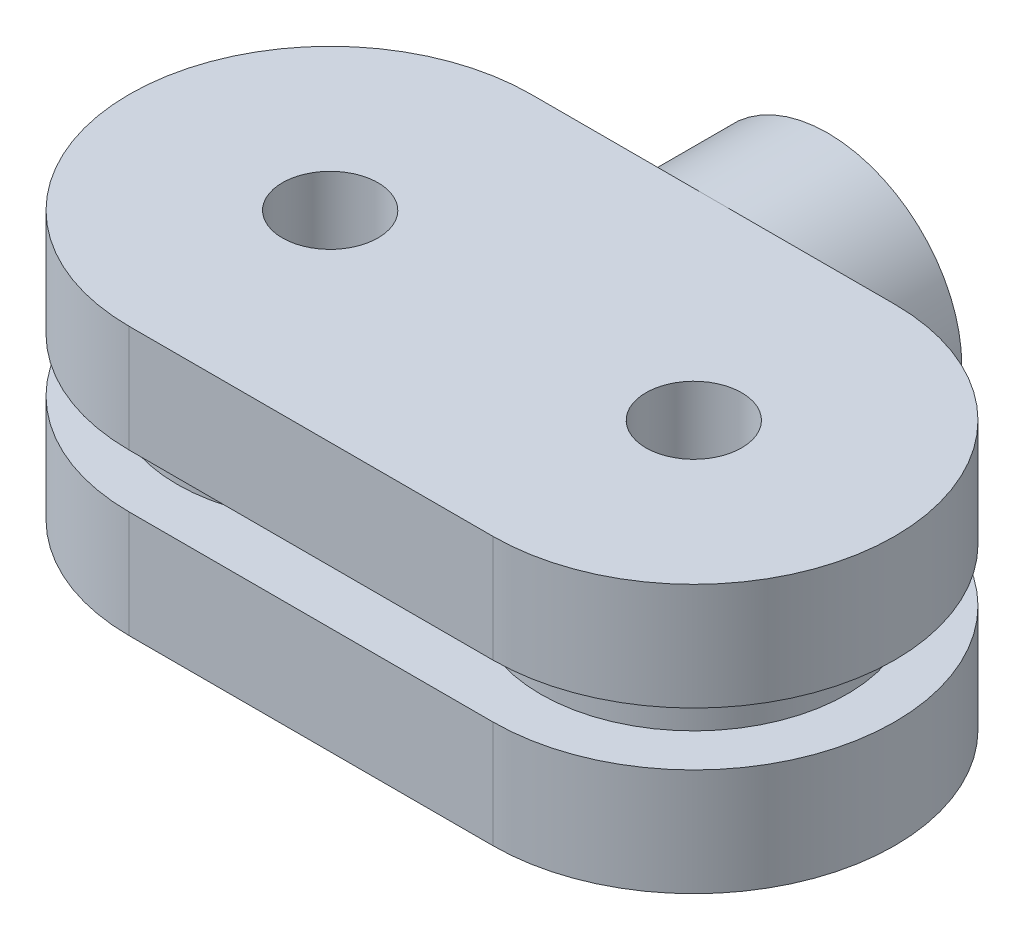
ISO-10303-21;
HEADER;
FILE_DESCRIPTION(('STEP AP214'),'2;1');
FILE_NAME('part.step','',(''),(''),'','','');
FILE_SCHEMA(('AUTOMOTIVE_DESIGN { 1 0 10303 214 1 1 1 1 }'));
ENDSEC;
DATA;
#1=APPLICATION_CONTEXT('core data for automotive mechanical design processes');
#2=APPLICATION_PROTOCOL_DEFINITION('international standard','automotive_design',2000,#1);
#3=PRODUCT_CONTEXT('',#1,'mechanical');
#4=PRODUCT('Part','Part','',(#3));
#5=PRODUCT_RELATED_PRODUCT_CATEGORY('part','',(#4));
#6=PRODUCT_DEFINITION_FORMATION('','',#4);
#7=PRODUCT_DEFINITION_CONTEXT('part definition',#1,'design');
#8=PRODUCT_DEFINITION('design','',#6,#7);
#9=PRODUCT_DEFINITION_SHAPE('','',#8);
#10=(LENGTH_UNIT() NAMED_UNIT(*) SI_UNIT(.MILLI.,.METRE.));
#11=(NAMED_UNIT(*) PLANE_ANGLE_UNIT() SI_UNIT($,.RADIAN.));
#12=(NAMED_UNIT(*) SI_UNIT($,.STERADIAN.) SOLID_ANGLE_UNIT());
#13=UNCERTAINTY_MEASURE_WITH_UNIT(LENGTH_MEASURE(1.E-05),#10,'distance_accuracy_value','');
#14=(GEOMETRIC_REPRESENTATION_CONTEXT(3) GLOBAL_UNCERTAINTY_ASSIGNED_CONTEXT((#13)) GLOBAL_UNIT_ASSIGNED_CONTEXT((#10,
#11,#12)) REPRESENTATION_CONTEXT('',''));
#15=CARTESIAN_POINT('',(0.,0.,0.));
#16=DIRECTION('',(0.,0.,1.));
#17=DIRECTION('',(1.,0.,0.));
#18=AXIS2_PLACEMENT_3D('',#15,#16,#17);
#19=CARTESIAN_POINT('',(0.,2.8,-5.25));
#20=DIRECTION('',(0.,0.,1.));
#21=DIRECTION('',(1.,0.,0.));
#22=AXIS2_PLACEMENT_3D('',#19,#20,#21);
#23=PLANE('',#22);
#24=DIRECTION('',(-1.,0.,0.));
#25=VECTOR('',#24,1.);
#26=CARTESIAN_POINT('',(0.,2.8,-5.25));
#27=LINE('',#26,#25);
#28=CARTESIAN_POINT('',(6.62349939951952,2.8,-5.25));
#29=VERTEX_POINT('',#28);
#30=CARTESIAN_POINT('',(2.87650060048048,2.8,-5.25));
#31=VERTEX_POINT('',#30);
#32=EDGE_CURVE('E57',#29,#31,#27,.T.);
#33=ORIENTED_EDGE('',*,*,#32,.F.);
#34=CARTESIAN_POINT('',(4.75,3.5,-5.25));
#35=DIRECTION('',(0.,0.,-1.));
#36=DIRECTION('',(-1.,0.,0.));
#37=AXIS2_PLACEMENT_3D('',#34,#35,#36);
#38=CIRCLE('',#37,2.);
#39=EDGE_CURVE('E54',#29,#31,#38,.T.);
#40=ORIENTED_EDGE('',*,*,#39,.T.);
#41=EDGE_LOOP('',(#33,#40));
#42=FACE_BOUND('',#41,.T.);
#43=ADVANCED_FACE('F40',(#42),#23,.F.);
#44=CARTESIAN_POINT('',(4.75,3.5,-5.25));
#45=DIRECTION('',(0.,0.,-1.));
#46=DIRECTION('',(-1.,0.,0.));
#47=AXIS2_PLACEMENT_3D('',#44,#45,#46);
#48=CIRCLE('',#47,3.5);
#49=CARTESIAN_POINT('',(8.17928563989645,2.8,-5.25));
#50=VERTEX_POINT('',#49);
#51=CARTESIAN_POINT('',(4.75,0.,-5.25));
#52=VERTEX_POINT('',#51);
#53=EDGE_CURVE('E164',#50,#52,#48,.T.);
#54=ORIENTED_EDGE('',*,*,#53,.F.);
#55=CARTESIAN_POINT('',(9.5,2.8,-5.25));
#56=VERTEX_POINT('',#55);
#57=EDGE_CURVE('E265',#56,#50,#27,.T.);
#58=ORIENTED_EDGE('',*,*,#57,.F.);
#59=DIRECTION('',(0.,-1.,0.));
#60=VECTOR('',#59,1.);
#61=CARTESIAN_POINT('',(9.5,2.8,-5.25));
#62=LINE('',#61,#60);
#63=CARTESIAN_POINT('',(9.5,0.,-5.25));
#64=VERTEX_POINT('',#63);
#65=EDGE_CURVE('E255',#56,#64,#62,.T.);
#66=ORIENTED_EDGE('',*,*,#65,.T.);
#67=DIRECTION('',(-1.,0.,0.));
#68=VECTOR('',#67,1.);
#69=CARTESIAN_POINT('',(0.,0.,-5.25));
#70=LINE('',#69,#68);
#71=EDGE_CURVE('E246',#64,#52,#70,.T.);
#72=ORIENTED_EDGE('',*,*,#71,.T.);
#73=EDGE_LOOP('',(#54,#58,#66,#72));
#74=FACE_BOUND('',#73,.T.);
#75=ADVANCED_FACE('F210',(#74),#23,.F.);
#76=CARTESIAN_POINT('',(0.,7.,-5.25));
#77=DIRECTION('',(0.,0.,1.));
#78=DIRECTION('',(1.,0.,0.));
#79=AXIS2_PLACEMENT_3D('',#76,#77,#78);
#80=PLANE('',#79);
#81=DIRECTION('',(-1.,0.,0.));
#82=VECTOR('',#81,1.);
#83=CARTESIAN_POINT('',(0.,4.2,-5.25));
#84=LINE('',#83,#82);
#85=CARTESIAN_POINT('',(6.62349939951952,4.2,-5.25));
#86=VERTEX_POINT('',#85);
#87=CARTESIAN_POINT('',(2.87650060048048,4.2,-5.25));
#88=VERTEX_POINT('',#87);
#89=EDGE_CURVE('E152',#86,#88,#84,.T.);
#90=ORIENTED_EDGE('',*,*,#89,.T.);
#91=EDGE_CURVE('E181',#88,#86,#38,.T.);
#92=ORIENTED_EDGE('',*,*,#91,.T.);
#93=EDGE_LOOP('',(#90,#92));
#94=FACE_BOUND('',#93,.T.);
#95=ADVANCED_FACE('F216',(#94),#80,.F.);
#96=CARTESIAN_POINT('',(1.32071436010355,4.2,-5.25));
#97=VERTEX_POINT('',#96);
#98=CARTESIAN_POINT('',(4.75,7.,-5.25));
#99=VERTEX_POINT('',#98);
#100=EDGE_CURVE('E163',#97,#99,#48,.T.);
#101=ORIENTED_EDGE('',*,*,#100,.F.);
#102=CARTESIAN_POINT('',(0.,4.2,-5.25));
#103=VERTEX_POINT('',#102);
#104=EDGE_CURVE('E145',#97,#103,#84,.T.);
#105=ORIENTED_EDGE('',*,*,#104,.T.);
#106=DIRECTION('',(0.,-1.,0.));
#107=VECTOR('',#106,1.);
#108=CARTESIAN_POINT('',(0.,7.,-5.25));
#109=LINE('',#108,#107);
#110=CARTESIAN_POINT('',(0.,7.,-5.25));
#111=VERTEX_POINT('',#110);
#112=EDGE_CURVE('E367',#111,#103,#109,.T.);
#113=ORIENTED_EDGE('',*,*,#112,.F.);
#114=DIRECTION('',(-1.,0.,0.));
#115=VECTOR('',#114,1.);
#116=CARTESIAN_POINT('',(0.,7.,-5.25));
#117=LINE('',#116,#115);
#118=EDGE_CURVE('E363',#99,#111,#117,.T.);
#119=ORIENTED_EDGE('',*,*,#118,.F.);
#120=EDGE_LOOP('',(#101,#105,#113,#119));
#121=FACE_BOUND('',#120,.T.);
#122=ADVANCED_FACE('F307',(#121),#80,.F.);
#123=CARTESIAN_POINT('',(0.,2.8,0.));
#124=DIRECTION('',(0.,1.,0.));
#125=DIRECTION('',(0.,0.,1.));
#126=AXIS2_PLACEMENT_3D('',#123,#124,#125);
#127=PLANE('',#126);
#128=CARTESIAN_POINT('',(0.,2.8,0.));
#129=DIRECTION('',(0.,1.,0.));
#130=DIRECTION('',(0.,0.,1.));
#131=AXIS2_PLACEMENT_3D('',#128,#129,#130);
#132=CIRCLE('',#131,5.25);
#133=CARTESIAN_POINT('',(0.,2.8,-5.25));
#134=VERTEX_POINT('',#133);
#135=CARTESIAN_POINT('',(0.,2.8,5.25));
#136=VERTEX_POINT('',#135);
#137=EDGE_CURVE('E256',#134,#136,#132,.T.);
#138=ORIENTED_EDGE('',*,*,#137,.T.);
#139=DIRECTION('',(1.,0.,0.));
#140=VECTOR('',#139,1.);
#141=CARTESIAN_POINT('',(0.,2.8,5.25));
#142=LINE('',#141,#140);
#143=CARTESIAN_POINT('',(9.5,2.8,5.25));
#144=VERTEX_POINT('',#143);
#145=EDGE_CURVE('E258',#136,#144,#142,.T.);
#146=ORIENTED_EDGE('',*,*,#145,.T.);
#147=CARTESIAN_POINT('',(9.5,2.8,0.));
#148=DIRECTION('',(0.,1.,0.));
#149=DIRECTION('',(0.,0.,1.));
#150=AXIS2_PLACEMENT_3D('',#147,#148,#149);
#151=CIRCLE('',#150,5.25);
#152=EDGE_CURVE('E288',#144,#56,#151,.T.);
#153=ORIENTED_EDGE('',*,*,#152,.T.);
#154=ORIENTED_EDGE('',*,*,#57,.T.);
#155=DIRECTION('',(-1.,0.,0.));
#156=VECTOR('',#155,1.);
#157=CARTESIAN_POINT('',(0.,2.8,-5.25));
#158=LINE('',#157,#156);
#159=EDGE_CURVE('E160',#50,#29,#158,.T.);
#160=ORIENTED_EDGE('',*,*,#159,.T.);
#161=ORIENTED_EDGE('',*,*,#32,.T.);
#162=CARTESIAN_POINT('',(1.32071436010355,2.8,-5.25));
#163=VERTEX_POINT('',#162);
#164=EDGE_CURVE('E194',#31,#163,#158,.T.);
#165=ORIENTED_EDGE('',*,*,#164,.T.);
#166=EDGE_CURVE('E238',#163,#134,#27,.T.);
#167=ORIENTED_EDGE('',*,*,#166,.T.);
#168=EDGE_LOOP('',(#138,#146,#153,#154,#160,#161,#165,#167));
#169=FACE_BOUND('',#168,.T.);
#170=CARTESIAN_POINT('',(0.,2.8,0.));
#171=DIRECTION('',(0.,1.,0.));
#172=DIRECTION('',(0.,0.,1.));
#173=AXIS2_PLACEMENT_3D('',#170,#171,#172);
#174=CIRCLE('',#173,4.);
#175=CARTESIAN_POINT('',(0.,2.8,4.));
#176=VERTEX_POINT('',#175);
#177=EDGE_CURVE('E48',#176,#176,#174,.T.);
#178=ORIENTED_EDGE('',*,*,#177,.F.);
#179=EDGE_LOOP('',(#178));
#180=FACE_BOUND('',#179,.T.);
#181=CARTESIAN_POINT('',(9.5,2.8,0.));
#182=DIRECTION('',(0.,1.,0.));
#183=DIRECTION('',(0.,0.,1.));
#184=AXIS2_PLACEMENT_3D('',#181,#182,#183);
#185=CIRCLE('',#184,4.);
#186=CARTESIAN_POINT('',(9.5,2.8,4.));
#187=VERTEX_POINT('',#186);
#188=EDGE_CURVE('E383',#187,#187,#185,.T.);
#189=ORIENTED_EDGE('',*,*,#188,.F.);
#190=EDGE_LOOP('',(#189));
#191=FACE_BOUND('',#190,.T.);
#192=ADVANCED_FACE('F296',(#169,#180,#191),#127,.T.);
#193=CARTESIAN_POINT('',(0.,0.,0.));
#194=DIRECTION('',(0.,1.,0.));
#195=DIRECTION('',(0.,0.,1.));
#196=AXIS2_PLACEMENT_3D('',#193,#194,#195);
#197=PLANE('',#196);
#198=CARTESIAN_POINT('',(0.,0.,0.));
#199=DIRECTION('',(0.,1.,0.));
#200=DIRECTION('',(0.,0.,1.));
#201=AXIS2_PLACEMENT_3D('',#198,#199,#200);
#202=CIRCLE('',#201,5.25);
#203=CARTESIAN_POINT('',(0.,0.,-5.25));
#204=VERTEX_POINT('',#203);
#205=CARTESIAN_POINT('',(0.,0.,5.25));
#206=VERTEX_POINT('',#205);
#207=EDGE_CURVE('E248',#204,#206,#202,.T.);
#208=ORIENTED_EDGE('',*,*,#207,.F.);
#209=EDGE_CURVE('E236',#52,#204,#70,.T.);
#210=ORIENTED_EDGE('',*,*,#209,.F.);
#211=ORIENTED_EDGE('',*,*,#71,.F.);
#212=CARTESIAN_POINT('',(9.5,0.,0.));
#213=DIRECTION('',(0.,1.,0.));
#214=DIRECTION('',(0.,0.,1.));
#215=AXIS2_PLACEMENT_3D('',#212,#213,#214);
#216=CIRCLE('',#215,5.25);
#217=CARTESIAN_POINT('',(9.5,0.,5.25));
#218=VERTEX_POINT('',#217);
#219=EDGE_CURVE('E249',#218,#64,#216,.T.);
#220=ORIENTED_EDGE('',*,*,#219,.F.);
#221=DIRECTION('',(1.,0.,0.));
#222=VECTOR('',#221,1.);
#223=CARTESIAN_POINT('',(0.,0.,5.25));
#224=LINE('',#223,#222);
#225=EDGE_CURVE('E291',#206,#218,#224,.T.);
#226=ORIENTED_EDGE('',*,*,#225,.F.);
#227=EDGE_LOOP('',(#208,#210,#211,#220,#226));
#228=FACE_BOUND('',#227,.T.);
#229=CARTESIAN_POINT('',(0.,0.,0.));
#230=DIRECTION('',(0.,1.,0.));
#231=DIRECTION('',(0.,0.,1.));
#232=AXIS2_PLACEMENT_3D('',#229,#230,#231);
#233=CIRCLE('',#232,1.25);
#234=CARTESIAN_POINT('',(0.,0.,1.25));
#235=VERTEX_POINT('',#234);
#236=EDGE_CURVE('E284',#235,#235,#233,.T.);
#237=ORIENTED_EDGE('',*,*,#236,.T.);
#238=EDGE_LOOP('',(#237));
#239=FACE_BOUND('',#238,.T.);
#240=CARTESIAN_POINT('',(9.5,0.,0.));
#241=DIRECTION('',(0.,1.,0.));
#242=DIRECTION('',(0.,0.,1.));
#243=AXIS2_PLACEMENT_3D('',#240,#241,#242);
#244=CIRCLE('',#243,1.25);
#245=CARTESIAN_POINT('',(9.5,0.,1.25));
#246=VERTEX_POINT('',#245);
#247=EDGE_CURVE('E281',#246,#246,#244,.T.);
#248=ORIENTED_EDGE('',*,*,#247,.T.);
#249=EDGE_LOOP('',(#248));
#250=FACE_BOUND('',#249,.T.);
#251=ADVANCED_FACE('F243',(#228,#239,#250),#197,.F.);
#252=CARTESIAN_POINT('',(0.,2.8,0.));
#253=DIRECTION('',(0.,-1.,0.));
#254=DIRECTION('',(0.,0.,-1.));
#255=AXIS2_PLACEMENT_3D('',#252,#253,#254);
#256=CYLINDRICAL_SURFACE('',#255,5.25);
#257=ORIENTED_EDGE('',*,*,#207,.T.);
#258=DIRECTION('',(0.,-1.,0.));
#259=VECTOR('',#258,1.);
#260=CARTESIAN_POINT('',(0.,2.8,5.25));
#261=LINE('',#260,#259);
#262=EDGE_CURVE('E269',#136,#206,#261,.T.);
#263=ORIENTED_EDGE('',*,*,#262,.F.);
#264=ORIENTED_EDGE('',*,*,#137,.F.);
#265=DIRECTION('',(0.,-1.,0.));
#266=VECTOR('',#265,1.);
#267=CARTESIAN_POINT('',(0.,2.8,-5.25));
#268=LINE('',#267,#266);
#269=EDGE_CURVE('E263',#134,#204,#268,.T.);
#270=ORIENTED_EDGE('',*,*,#269,.T.);
#271=EDGE_LOOP('',(#257,#263,#264,#270));
#272=FACE_BOUND('',#271,.T.);
#273=ADVANCED_FACE('F42',(#272),#256,.T.);
#274=CARTESIAN_POINT('',(0.,2.8,5.25));
#275=DIRECTION('',(0.,0.,-1.));
#276=DIRECTION('',(-1.,0.,0.));
#277=AXIS2_PLACEMENT_3D('',#274,#275,#276);
#278=PLANE('',#277);
#279=ORIENTED_EDGE('',*,*,#225,.T.);
#280=DIRECTION('',(0.,-1.,0.));
#281=VECTOR('',#280,1.);
#282=CARTESIAN_POINT('',(9.5,2.8,5.25));
#283=LINE('',#282,#281);
#284=EDGE_CURVE('E267',#144,#218,#283,.T.);
#285=ORIENTED_EDGE('',*,*,#284,.F.);
#286=ORIENTED_EDGE('',*,*,#145,.F.);
#287=ORIENTED_EDGE('',*,*,#262,.T.);
#288=EDGE_LOOP('',(#279,#285,#286,#287));
#289=FACE_BOUND('',#288,.T.);
#290=ADVANCED_FACE('F231',(#289),#278,.F.);
#291=CARTESIAN_POINT('',(9.5,2.8,0.));
#292=DIRECTION('',(0.,-1.,0.));
#293=DIRECTION('',(0.,0.,-1.));
#294=AXIS2_PLACEMENT_3D('',#291,#292,#293);
#295=CYLINDRICAL_SURFACE('',#294,5.25);
#296=ORIENTED_EDGE('',*,*,#219,.T.);
#297=ORIENTED_EDGE('',*,*,#65,.F.);
#298=ORIENTED_EDGE('',*,*,#152,.F.);
#299=ORIENTED_EDGE('',*,*,#284,.T.);
#300=EDGE_LOOP('',(#296,#297,#298,#299));
#301=FACE_BOUND('',#300,.T.);
#302=ADVANCED_FACE('F222',(#301),#295,.T.);
#303=EDGE_CURVE('E180',#52,#163,#48,.T.);
#304=ORIENTED_EDGE('',*,*,#303,.F.);
#305=ORIENTED_EDGE('',*,*,#209,.T.);
#306=ORIENTED_EDGE('',*,*,#269,.F.);
#307=ORIENTED_EDGE('',*,*,#166,.F.);
#308=EDGE_LOOP('',(#304,#305,#306,#307));
#309=FACE_BOUND('',#308,.T.);
#310=ADVANCED_FACE('F212',(#309),#23,.F.);
#311=CARTESIAN_POINT('',(0.,2.8,0.));
#312=DIRECTION('',(0.,-1.,0.));
#313=DIRECTION('',(0.,0.,-1.));
#314=AXIS2_PLACEMENT_3D('',#311,#312,#313);
#315=CYLINDRICAL_SURFACE('',#314,1.25);
#316=ORIENTED_EDGE('',*,*,#236,.F.);
#317=EDGE_LOOP('',(#316));
#318=FACE_BOUND('',#317,.T.);
#319=CARTESIAN_POINT('',(0.,7.,0.));
#320=DIRECTION('',(0.,1.,0.));
#321=DIRECTION('',(0.,0.,1.));
#322=AXIS2_PLACEMENT_3D('',#319,#320,#321);
#323=CIRCLE('',#322,1.25);
#324=CARTESIAN_POINT('',(0.,7.,1.25));
#325=VERTEX_POINT('',#324);
#326=EDGE_CURVE('E345',#325,#325,#323,.T.);
#327=ORIENTED_EDGE('',*,*,#326,.T.);
#328=EDGE_LOOP('',(#327));
#329=FACE_BOUND('',#328,.T.);
#330=ADVANCED_FACE('F221',(#318,#329),#315,.F.);
#331=CARTESIAN_POINT('',(9.5,2.8,0.));
#332=DIRECTION('',(0.,-1.,0.));
#333=DIRECTION('',(0.,0.,-1.));
#334=AXIS2_PLACEMENT_3D('',#331,#332,#333);
#335=CYLINDRICAL_SURFACE('',#334,1.25);
#336=ORIENTED_EDGE('',*,*,#247,.F.);
#337=EDGE_LOOP('',(#336));
#338=FACE_BOUND('',#337,.T.);
#339=CARTESIAN_POINT('',(9.5,7.,0.));
#340=DIRECTION('',(0.,1.,0.));
#341=DIRECTION('',(0.,0.,1.));
#342=AXIS2_PLACEMENT_3D('',#339,#340,#341);
#343=CIRCLE('',#342,1.25);
#344=CARTESIAN_POINT('',(9.5,7.,1.25));
#345=VERTEX_POINT('',#344);
#346=EDGE_CURVE('E352',#345,#345,#343,.T.);
#347=ORIENTED_EDGE('',*,*,#346,.T.);
#348=EDGE_LOOP('',(#347));
#349=FACE_BOUND('',#348,.T.);
#350=ADVANCED_FACE('F228',(#338,#349),#335,.F.);
#351=CARTESIAN_POINT('',(0.,4.2,0.));
#352=DIRECTION('',(0.,-1.,0.));
#353=DIRECTION('',(0.,0.,-1.));
#354=AXIS2_PLACEMENT_3D('',#351,#352,#353);
#355=CYLINDRICAL_SURFACE('',#354,4.);
#356=CARTESIAN_POINT('',(0.,4.2,0.));
#357=DIRECTION('',(0.,1.,0.));
#358=DIRECTION('',(0.,0.,1.));
#359=AXIS2_PLACEMENT_3D('',#356,#357,#358);
#360=CIRCLE('',#359,4.);
#361=CARTESIAN_POINT('',(0.,4.2,4.));
#362=VERTEX_POINT('',#361);
#363=EDGE_CURVE('E279',#362,#362,#360,.T.);
#364=ORIENTED_EDGE('',*,*,#363,.F.);
#365=EDGE_LOOP('',(#364));
#366=FACE_BOUND('',#365,.T.);
#367=ORIENTED_EDGE('',*,*,#177,.T.);
#368=EDGE_LOOP('',(#367));
#369=FACE_BOUND('',#368,.T.);
#370=ADVANCED_FACE('F312',(#366,#369),#355,.T.);
#371=CARTESIAN_POINT('',(9.5,4.2,0.));
#372=DIRECTION('',(0.,-1.,0.));
#373=DIRECTION('',(0.,0.,-1.));
#374=AXIS2_PLACEMENT_3D('',#371,#372,#373);
#375=CYLINDRICAL_SURFACE('',#374,4.);
#376=CARTESIAN_POINT('',(9.5,4.2,0.));
#377=DIRECTION('',(0.,1.,0.));
#378=DIRECTION('',(0.,0.,1.));
#379=AXIS2_PLACEMENT_3D('',#376,#377,#378);
#380=CIRCLE('',#379,4.);
#381=CARTESIAN_POINT('',(9.5,4.2,4.));
#382=VERTEX_POINT('',#381);
#383=EDGE_CURVE('E384',#382,#382,#380,.T.);
#384=ORIENTED_EDGE('',*,*,#383,.F.);
#385=EDGE_LOOP('',(#384));
#386=FACE_BOUND('',#385,.T.);
#387=ORIENTED_EDGE('',*,*,#188,.T.);
#388=EDGE_LOOP('',(#387));
#389=FACE_BOUND('',#388,.T.);
#390=ADVANCED_FACE('F316',(#386,#389),#375,.T.);
#391=CARTESIAN_POINT('',(0.,7.,0.));
#392=DIRECTION('',(0.,1.,0.));
#393=DIRECTION('',(0.,0.,1.));
#394=AXIS2_PLACEMENT_3D('',#391,#392,#393);
#395=PLANE('',#394);
#396=ORIENTED_EDGE('',*,*,#326,.F.);
#397=EDGE_LOOP('',(#396));
#398=FACE_BOUND('',#397,.T.);
#399=CARTESIAN_POINT('',(0.,7.,0.));
#400=DIRECTION('',(0.,1.,0.));
#401=DIRECTION('',(0.,0.,1.));
#402=AXIS2_PLACEMENT_3D('',#399,#400,#401);
#403=CIRCLE('',#402,5.25);
#404=CARTESIAN_POINT('',(0.,7.,5.25));
#405=VERTEX_POINT('',#404);
#406=EDGE_CURVE('E142',#111,#405,#403,.T.);
#407=ORIENTED_EDGE('',*,*,#406,.T.);
#408=DIRECTION('',(1.,0.,0.));
#409=VECTOR('',#408,1.);
#410=CARTESIAN_POINT('',(0.,7.,5.25));
#411=LINE('',#410,#409);
#412=CARTESIAN_POINT('',(9.5,7.,5.25));
#413=VERTEX_POINT('',#412);
#414=EDGE_CURVE('E359',#405,#413,#411,.T.);
#415=ORIENTED_EDGE('',*,*,#414,.T.);
#416=CARTESIAN_POINT('',(9.5,7.,0.));
#417=DIRECTION('',(0.,1.,0.));
#418=DIRECTION('',(0.,0.,1.));
#419=AXIS2_PLACEMENT_3D('',#416,#417,#418);
#420=CIRCLE('',#419,5.25);
#421=CARTESIAN_POINT('',(9.5,7.,-5.25));
#422=VERTEX_POINT('',#421);
#423=EDGE_CURVE('E361',#413,#422,#420,.T.);
#424=ORIENTED_EDGE('',*,*,#423,.T.);
#425=EDGE_CURVE('E364',#422,#99,#117,.T.);
#426=ORIENTED_EDGE('',*,*,#425,.T.);
#427=ORIENTED_EDGE('',*,*,#118,.T.);
#428=EDGE_LOOP('',(#407,#415,#424,#426,#427));
#429=FACE_BOUND('',#428,.T.);
#430=ORIENTED_EDGE('',*,*,#346,.F.);
#431=EDGE_LOOP('',(#430));
#432=FACE_BOUND('',#431,.T.);
#433=ADVANCED_FACE('F320',(#398,#429,#432),#395,.T.);
#434=CARTESIAN_POINT('',(0.,4.2,0.));
#435=DIRECTION('',(0.,1.,0.));
#436=DIRECTION('',(0.,0.,1.));
#437=AXIS2_PLACEMENT_3D('',#434,#435,#436);
#438=PLANE('',#437);
#439=ORIENTED_EDGE('',*,*,#363,.T.);
#440=EDGE_LOOP('',(#439));
#441=FACE_BOUND('',#440,.T.);
#442=ORIENTED_EDGE('',*,*,#383,.T.);
#443=EDGE_LOOP('',(#442));
#444=FACE_BOUND('',#443,.T.);
#445=CARTESIAN_POINT('',(0.,4.2,0.));
#446=DIRECTION('',(0.,1.,0.));
#447=DIRECTION('',(0.,0.,1.));
#448=AXIS2_PLACEMENT_3D('',#445,#446,#447);
#449=CIRCLE('',#448,5.25);
#450=CARTESIAN_POINT('',(0.,4.2,5.25));
#451=VERTEX_POINT('',#450);
#452=EDGE_CURVE('E355',#103,#451,#449,.T.);
#453=ORIENTED_EDGE('',*,*,#452,.F.);
#454=ORIENTED_EDGE('',*,*,#104,.F.);
#455=EDGE_CURVE('E193',#88,#97,#84,.T.);
#456=ORIENTED_EDGE('',*,*,#455,.F.);
#457=ORIENTED_EDGE('',*,*,#89,.F.);
#458=CARTESIAN_POINT('',(8.17928563989645,4.2,-5.25));
#459=VERTEX_POINT('',#458);
#460=EDGE_CURVE('E143',#459,#86,#84,.T.);
#461=ORIENTED_EDGE('',*,*,#460,.F.);
#462=CARTESIAN_POINT('',(9.5,4.2,-5.25));
#463=VERTEX_POINT('',#462);
#464=EDGE_CURVE('E133',#463,#459,#84,.T.);
#465=ORIENTED_EDGE('',*,*,#464,.F.);
#466=CARTESIAN_POINT('',(9.5,4.2,0.));
#467=DIRECTION('',(0.,1.,0.));
#468=DIRECTION('',(0.,0.,1.));
#469=AXIS2_PLACEMENT_3D('',#466,#467,#468);
#470=CIRCLE('',#469,5.25);
#471=CARTESIAN_POINT('',(9.5,4.2,5.25));
#472=VERTEX_POINT('',#471);
#473=EDGE_CURVE('E372',#472,#463,#470,.T.);
#474=ORIENTED_EDGE('',*,*,#473,.F.);
#475=DIRECTION('',(1.,0.,0.));
#476=VECTOR('',#475,1.);
#477=CARTESIAN_POINT('',(0.,4.2,5.25));
#478=LINE('',#477,#476);
#479=EDGE_CURVE('E370',#451,#472,#478,.T.);
#480=ORIENTED_EDGE('',*,*,#479,.F.);
#481=EDGE_LOOP('',(#453,#454,#456,#457,#461,#465,#474,#480));
#482=FACE_BOUND('',#481,.T.);
#483=ADVANCED_FACE('F150',(#441,#444,#482),#438,.F.);
#484=CARTESIAN_POINT('',(0.,7.,0.));
#485=DIRECTION('',(0.,-1.,0.));
#486=DIRECTION('',(0.,0.,-1.));
#487=AXIS2_PLACEMENT_3D('',#484,#485,#486);
#488=CYLINDRICAL_SURFACE('',#487,5.25);
#489=ORIENTED_EDGE('',*,*,#452,.T.);
#490=DIRECTION('',(0.,-1.,0.));
#491=VECTOR('',#490,1.);
#492=CARTESIAN_POINT('',(0.,7.,5.25));
#493=LINE('',#492,#491);
#494=EDGE_CURVE('E380',#405,#451,#493,.T.);
#495=ORIENTED_EDGE('',*,*,#494,.F.);
#496=ORIENTED_EDGE('',*,*,#406,.F.);
#497=ORIENTED_EDGE('',*,*,#112,.T.);
#498=EDGE_LOOP('',(#489,#495,#496,#497));
#499=FACE_BOUND('',#498,.T.);
#500=ADVANCED_FACE('F322',(#499),#488,.T.);
#501=CARTESIAN_POINT('',(0.,7.,5.25));
#502=DIRECTION('',(0.,0.,-1.));
#503=DIRECTION('',(-1.,0.,0.));
#504=AXIS2_PLACEMENT_3D('',#501,#502,#503);
#505=PLANE('',#504);
#506=ORIENTED_EDGE('',*,*,#479,.T.);
#507=DIRECTION('',(0.,-1.,0.));
#508=VECTOR('',#507,1.);
#509=CARTESIAN_POINT('',(9.5,7.,5.25));
#510=LINE('',#509,#508);
#511=EDGE_CURVE('E377',#413,#472,#510,.T.);
#512=ORIENTED_EDGE('',*,*,#511,.F.);
#513=ORIENTED_EDGE('',*,*,#414,.F.);
#514=ORIENTED_EDGE('',*,*,#494,.T.);
#515=EDGE_LOOP('',(#506,#512,#513,#514));
#516=FACE_BOUND('',#515,.T.);
#517=ADVANCED_FACE('F325',(#516),#505,.F.);
#518=CARTESIAN_POINT('',(9.5,7.,0.));
#519=DIRECTION('',(0.,-1.,0.));
#520=DIRECTION('',(0.,0.,-1.));
#521=AXIS2_PLACEMENT_3D('',#518,#519,#520);
#522=CYLINDRICAL_SURFACE('',#521,5.25);
#523=ORIENTED_EDGE('',*,*,#473,.T.);
#524=DIRECTION('',(0.,-1.,0.));
#525=VECTOR('',#524,1.);
#526=CARTESIAN_POINT('',(9.5,7.,-5.25));
#527=LINE('',#526,#525);
#528=EDGE_CURVE('E139',#422,#463,#527,.T.);
#529=ORIENTED_EDGE('',*,*,#528,.F.);
#530=ORIENTED_EDGE('',*,*,#423,.F.);
#531=ORIENTED_EDGE('',*,*,#511,.T.);
#532=EDGE_LOOP('',(#523,#529,#530,#531));
#533=FACE_BOUND('',#532,.T.);
#534=ADVANCED_FACE('F329',(#533),#522,.T.);
#535=CARTESIAN_POINT('',(4.75,3.5,-5.25));
#536=DIRECTION('',(0.,0.,1.));
#537=DIRECTION('',(1.,0.,0.));
#538=AXIS2_PLACEMENT_3D('',#535,#536,#537);
#539=CIRCLE('',#538,3.5);
#540=EDGE_CURVE('E11',#99,#459,#539,.F.);
#541=ORIENTED_EDGE('',*,*,#540,.F.);
#542=ORIENTED_EDGE('',*,*,#425,.F.);
#543=ORIENTED_EDGE('',*,*,#528,.T.);
#544=ORIENTED_EDGE('',*,*,#464,.T.);
#545=EDGE_LOOP('',(#541,#542,#543,#544));
#546=FACE_BOUND('',#545,.T.);
#547=ADVANCED_FACE('F135',(#546),#80,.F.);
#548=CARTESIAN_POINT('',(0.,0.,-5.25));
#549=DIRECTION('',(0.,0.,-1.));
#550=DIRECTION('',(-1.,0.,0.));
#551=AXIS2_PLACEMENT_3D('',#548,#549,#550);
#552=PLANE('',#551);
#553=ORIENTED_EDGE('',*,*,#159,.F.);
#554=EDGE_CURVE('E158',#459,#50,#48,.T.);
#555=ORIENTED_EDGE('',*,*,#554,.F.);
#556=ORIENTED_EDGE('',*,*,#460,.T.);
#557=EDGE_CURVE('E182',#86,#29,#38,.T.);
#558=ORIENTED_EDGE('',*,*,#557,.T.);
#559=EDGE_LOOP('',(#553,#555,#556,#558));
#560=FACE_BOUND('',#559,.T.);
#561=ADVANCED_FACE('F159',(#560),#552,.F.);
#562=ORIENTED_EDGE('',*,*,#164,.F.);
#563=EDGE_CURVE('E183',#31,#88,#38,.T.);
#564=ORIENTED_EDGE('',*,*,#563,.T.);
#565=ORIENTED_EDGE('',*,*,#455,.T.);
#566=EDGE_CURVE('E171',#163,#97,#48,.T.);
#567=ORIENTED_EDGE('',*,*,#566,.F.);
#568=EDGE_LOOP('',(#562,#564,#565,#567));
#569=FACE_BOUND('',#568,.T.);
#570=ADVANCED_FACE('F192',(#569),#552,.F.);
#571=CARTESIAN_POINT('',(4.75,3.5,-8.25));
#572=DIRECTION('',(0.,0.,1.));
#573=DIRECTION('',(1.,0.,0.));
#574=AXIS2_PLACEMENT_3D('',#571,#572,#573);
#575=CYLINDRICAL_SURFACE('',#574,2.);
#576=CARTESIAN_POINT('',(4.75,3.5,-8.25));
#577=DIRECTION('',(0.,0.,-1.));
#578=DIRECTION('',(-1.,0.,0.));
#579=AXIS2_PLACEMENT_3D('',#576,#577,#578);
#580=CIRCLE('',#579,2.);
#581=CARTESIAN_POINT('',(2.75,3.5,-8.25));
#582=VERTEX_POINT('',#581);
#583=EDGE_CURVE('E174',#582,#582,#580,.T.);
#584=ORIENTED_EDGE('',*,*,#583,.T.);
#585=EDGE_LOOP('',(#584));
#586=FACE_BOUND('',#585,.T.);
#587=ORIENTED_EDGE('',*,*,#91,.F.);
#588=ORIENTED_EDGE('',*,*,#563,.F.);
#589=ORIENTED_EDGE('',*,*,#39,.F.);
#590=ORIENTED_EDGE('',*,*,#557,.F.);
#591=EDGE_LOOP('',(#587,#588,#589,#590));
#592=FACE_BOUND('',#591,.T.);
#593=ADVANCED_FACE('F196',(#586,#592),#575,.F.);
#594=CARTESIAN_POINT('',(4.75,3.5,-8.25));
#595=DIRECTION('',(0.,0.,1.));
#596=DIRECTION('',(1.,0.,0.));
#597=AXIS2_PLACEMENT_3D('',#594,#595,#596);
#598=CYLINDRICAL_SURFACE('',#597,3.5);
#599=CARTESIAN_POINT('',(4.75,3.5,-8.25));
#600=DIRECTION('',(0.,0.,-1.));
#601=DIRECTION('',(-1.,0.,0.));
#602=AXIS2_PLACEMENT_3D('',#599,#600,#601);
#603=CIRCLE('',#602,3.5);
#604=CARTESIAN_POINT('',(1.25,3.5,-8.25));
#605=VERTEX_POINT('',#604);
#606=EDGE_CURVE('E176',#605,#605,#603,.T.);
#607=ORIENTED_EDGE('',*,*,#606,.F.);
#608=EDGE_LOOP('',(#607));
#609=FACE_BOUND('',#608,.T.);
#610=ORIENTED_EDGE('',*,*,#100,.T.);
#611=ORIENTED_EDGE('',*,*,#540,.T.);
#612=ORIENTED_EDGE('',*,*,#554,.T.);
#613=ORIENTED_EDGE('',*,*,#53,.T.);
#614=ORIENTED_EDGE('',*,*,#303,.T.);
#615=ORIENTED_EDGE('',*,*,#566,.T.);
#616=EDGE_LOOP('',(#610,#611,#612,#613,#614,#615));
#617=FACE_BOUND('',#616,.T.);
#618=ADVANCED_FACE('F167',(#609,#617),#598,.T.);
#619=CARTESIAN_POINT('',(0.,0.,-8.25));
#620=DIRECTION('',(0.,0.,-1.));
#621=DIRECTION('',(-1.,0.,0.));
#622=AXIS2_PLACEMENT_3D('',#619,#620,#621);
#623=PLANE('',#622);
#624=ORIENTED_EDGE('',*,*,#583,.F.);
#625=EDGE_LOOP('',(#624));
#626=FACE_BOUND('',#625,.T.);
#627=ORIENTED_EDGE('',*,*,#606,.T.);
#628=EDGE_LOOP('',(#627));
#629=FACE_BOUND('',#628,.T.);
#630=ADVANCED_FACE('F204',(#626,#629),#623,.T.);
#631=CLOSED_SHELL('',(#43,#75,#95,#122,#192,#251,#273,#290,#302,#310,#330,#350,#370,#390,#433,
#483,#500,#517,#534,#547,#561,#570,#593,#618,#630));
#632=MANIFOLD_SOLID_BREP('B2',#631);
#633=ADVANCED_BREP_SHAPE_REPRESENTATION('',(#18,#632),#14);
#634=SHAPE_DEFINITION_REPRESENTATION(#9,#633);
ENDSEC;
END-ISO-10303-21;
